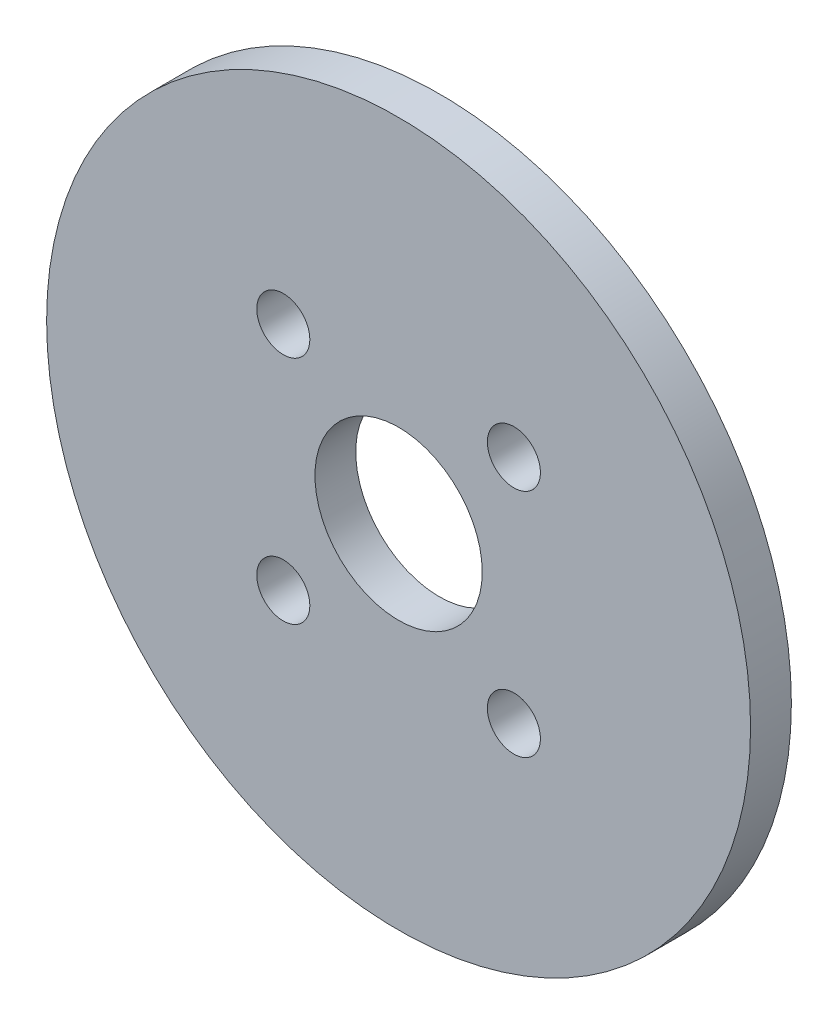
ISO-10303-21;
HEADER;
FILE_DESCRIPTION(('STEP AP214'),'2;1');
FILE_NAME('part.step','',(''),(''),'','','');
FILE_SCHEMA(('AUTOMOTIVE_DESIGN { 1 0 10303 214 1 1 1 1 }'));
ENDSEC;
DATA;
#1=APPLICATION_CONTEXT('core data for automotive mechanical design processes');
#2=APPLICATION_PROTOCOL_DEFINITION('international standard','automotive_design',2000,#1);
#3=PRODUCT_CONTEXT('',#1,'mechanical');
#4=PRODUCT('Part','Part','',(#3));
#5=PRODUCT_RELATED_PRODUCT_CATEGORY('part','',(#4));
#6=PRODUCT_DEFINITION_FORMATION('','',#4);
#7=PRODUCT_DEFINITION_CONTEXT('part definition',#1,'design');
#8=PRODUCT_DEFINITION('design','',#6,#7);
#9=PRODUCT_DEFINITION_SHAPE('','',#8);
#10=(LENGTH_UNIT() NAMED_UNIT(*) SI_UNIT(.MILLI.,.METRE.));
#11=(NAMED_UNIT(*) PLANE_ANGLE_UNIT() SI_UNIT($,.RADIAN.));
#12=(NAMED_UNIT(*) SI_UNIT($,.STERADIAN.) SOLID_ANGLE_UNIT());
#13=UNCERTAINTY_MEASURE_WITH_UNIT(LENGTH_MEASURE(1.E-05),#10,'distance_accuracy_value','');
#14=(GEOMETRIC_REPRESENTATION_CONTEXT(3) GLOBAL_UNCERTAINTY_ASSIGNED_CONTEXT((#13)) GLOBAL_UNIT_ASSIGNED_CONTEXT((#10,
#11,#12)) REPRESENTATION_CONTEXT('',''));
#15=CARTESIAN_POINT('',(0.,0.,0.));
#16=DIRECTION('',(0.,0.,1.));
#17=DIRECTION('',(1.,0.,0.));
#18=AXIS2_PLACEMENT_3D('',#15,#16,#17);
#19=CARTESIAN_POINT('',(0.,0.,2.));
#20=DIRECTION('',(0.,0.,1.));
#21=DIRECTION('',(1.,0.,0.));
#22=AXIS2_PLACEMENT_3D('',#19,#20,#21);
#23=PLANE('',#22);
#24=CARTESIAN_POINT('',(-5.65,-5.65,2.));
#25=DIRECTION('',(0.,0.,1.));
#26=DIRECTION('',(1.,0.,0.));
#27=AXIS2_PLACEMENT_3D('',#24,#25,#26);
#28=CIRCLE('',#27,1.3);
#29=CARTESIAN_POINT('',(-4.35,-5.65,2.));
#30=VERTEX_POINT('',#29);
#31=EDGE_CURVE('E62',#30,#30,#28,.T.);
#32=ORIENTED_EDGE('',*,*,#31,.F.);
#33=EDGE_LOOP('',(#32));
#34=FACE_BOUND('',#33,.T.);
#35=CARTESIAN_POINT('',(5.65,-5.65,2.));
#36=DIRECTION('',(0.,0.,1.));
#37=DIRECTION('',(1.,0.,0.));
#38=AXIS2_PLACEMENT_3D('',#35,#36,#37);
#39=CIRCLE('',#38,1.3);
#40=CARTESIAN_POINT('',(6.95,-5.65,2.));
#41=VERTEX_POINT('',#40);
#42=EDGE_CURVE('E50',#41,#41,#39,.T.);
#43=ORIENTED_EDGE('',*,*,#42,.F.);
#44=EDGE_LOOP('',(#43));
#45=FACE_BOUND('',#44,.T.);
#46=CARTESIAN_POINT('',(0.,0.,2.));
#47=DIRECTION('',(0.,0.,1.));
#48=DIRECTION('',(1.,0.,0.));
#49=AXIS2_PLACEMENT_3D('',#46,#47,#48);
#50=CIRCLE('',#49,17.25);
#51=CARTESIAN_POINT('',(17.25,0.,2.));
#52=VERTEX_POINT('',#51);
#53=EDGE_CURVE('E10',#52,#52,#50,.T.);
#54=ORIENTED_EDGE('',*,*,#53,.T.);
#55=EDGE_LOOP('',(#54));
#56=FACE_BOUND('',#55,.T.);
#57=CARTESIAN_POINT('',(5.65,5.65,2.));
#58=DIRECTION('',(0.,0.,1.));
#59=DIRECTION('',(1.,0.,0.));
#60=AXIS2_PLACEMENT_3D('',#57,#58,#59);
#61=CIRCLE('',#60,1.3);
#62=CARTESIAN_POINT('',(6.95,5.65,2.));
#63=VERTEX_POINT('',#62);
#64=EDGE_CURVE('E45',#63,#63,#61,.T.);
#65=ORIENTED_EDGE('',*,*,#64,.F.);
#66=EDGE_LOOP('',(#65));
#67=FACE_BOUND('',#66,.T.);
#68=CARTESIAN_POINT('',(-5.65,5.65,2.));
#69=DIRECTION('',(0.,0.,1.));
#70=DIRECTION('',(1.,0.,0.));
#71=AXIS2_PLACEMENT_3D('',#68,#69,#70);
#72=CIRCLE('',#71,1.3);
#73=CARTESIAN_POINT('',(-4.35,5.65,2.));
#74=VERTEX_POINT('',#73);
#75=EDGE_CURVE('E56',#74,#74,#72,.T.);
#76=ORIENTED_EDGE('',*,*,#75,.F.);
#77=EDGE_LOOP('',(#76));
#78=FACE_BOUND('',#77,.T.);
#79=CARTESIAN_POINT('',(0.,0.,2.));
#80=DIRECTION('',(0.,0.,1.));
#81=DIRECTION('',(1.,0.,0.));
#82=AXIS2_PLACEMENT_3D('',#79,#80,#81);
#83=CIRCLE('',#82,4.1);
#84=CARTESIAN_POINT('',(4.1,0.,2.));
#85=VERTEX_POINT('',#84);
#86=EDGE_CURVE('E68',#85,#85,#83,.T.);
#87=ORIENTED_EDGE('',*,*,#86,.F.);
#88=EDGE_LOOP('',(#87));
#89=FACE_BOUND('',#88,.T.);
#90=ADVANCED_FACE('F34',(#34,#45,#56,#67,#78,#89),#23,.T.);
#91=CARTESIAN_POINT('',(0.,0.,0.));
#92=DIRECTION('',(0.,0.,1.));
#93=DIRECTION('',(1.,0.,0.));
#94=AXIS2_PLACEMENT_3D('',#91,#92,#93);
#95=PLANE('',#94);
#96=CARTESIAN_POINT('',(0.,0.,0.));
#97=DIRECTION('',(0.,0.,1.));
#98=DIRECTION('',(1.,0.,0.));
#99=AXIS2_PLACEMENT_3D('',#96,#97,#98);
#100=CIRCLE('',#99,17.25);
#101=CARTESIAN_POINT('',(17.25,0.,0.));
#102=VERTEX_POINT('',#101);
#103=EDGE_CURVE('E38',#102,#102,#100,.T.);
#104=ORIENTED_EDGE('',*,*,#103,.F.);
#105=EDGE_LOOP('',(#104));
#106=FACE_BOUND('',#105,.T.);
#107=CARTESIAN_POINT('',(5.65,5.65,0.));
#108=DIRECTION('',(0.,0.,1.));
#109=DIRECTION('',(1.,0.,0.));
#110=AXIS2_PLACEMENT_3D('',#107,#108,#109);
#111=CIRCLE('',#110,1.3);
#112=CARTESIAN_POINT('',(6.95,5.65,0.));
#113=VERTEX_POINT('',#112);
#114=EDGE_CURVE('E47',#113,#113,#111,.T.);
#115=ORIENTED_EDGE('',*,*,#114,.T.);
#116=EDGE_LOOP('',(#115));
#117=FACE_BOUND('',#116,.T.);
#118=CARTESIAN_POINT('',(5.65,-5.65,0.));
#119=DIRECTION('',(0.,0.,1.));
#120=DIRECTION('',(1.,0.,0.));
#121=AXIS2_PLACEMENT_3D('',#118,#119,#120);
#122=CIRCLE('',#121,1.3);
#123=CARTESIAN_POINT('',(6.95,-5.65,0.));
#124=VERTEX_POINT('',#123);
#125=EDGE_CURVE('E53',#124,#124,#122,.T.);
#126=ORIENTED_EDGE('',*,*,#125,.T.);
#127=EDGE_LOOP('',(#126));
#128=FACE_BOUND('',#127,.T.);
#129=CARTESIAN_POINT('',(-5.65,5.65,0.));
#130=DIRECTION('',(0.,0.,1.));
#131=DIRECTION('',(1.,0.,0.));
#132=AXIS2_PLACEMENT_3D('',#129,#130,#131);
#133=CIRCLE('',#132,1.3);
#134=CARTESIAN_POINT('',(-4.35,5.65,0.));
#135=VERTEX_POINT('',#134);
#136=EDGE_CURVE('E59',#135,#135,#133,.T.);
#137=ORIENTED_EDGE('',*,*,#136,.T.);
#138=EDGE_LOOP('',(#137));
#139=FACE_BOUND('',#138,.T.);
#140=CARTESIAN_POINT('',(-5.65,-5.65,0.));
#141=DIRECTION('',(0.,0.,1.));
#142=DIRECTION('',(1.,0.,0.));
#143=AXIS2_PLACEMENT_3D('',#140,#141,#142);
#144=CIRCLE('',#143,1.3);
#145=CARTESIAN_POINT('',(-4.35,-5.65,0.));
#146=VERTEX_POINT('',#145);
#147=EDGE_CURVE('E65',#146,#146,#144,.T.);
#148=ORIENTED_EDGE('',*,*,#147,.T.);
#149=EDGE_LOOP('',(#148));
#150=FACE_BOUND('',#149,.T.);
#151=CARTESIAN_POINT('',(0.,0.,0.));
#152=DIRECTION('',(0.,0.,1.));
#153=DIRECTION('',(1.,0.,0.));
#154=AXIS2_PLACEMENT_3D('',#151,#152,#153);
#155=CIRCLE('',#154,4.1);
#156=CARTESIAN_POINT('',(4.1,0.,0.));
#157=VERTEX_POINT('',#156);
#158=EDGE_CURVE('E71',#157,#157,#155,.T.);
#159=ORIENTED_EDGE('',*,*,#158,.T.);
#160=EDGE_LOOP('',(#159));
#161=FACE_BOUND('',#160,.T.);
#162=ADVANCED_FACE('F81',(#106,#117,#128,#139,#150,#161),#95,.F.);
#163=CARTESIAN_POINT('',(0.,0.,2.));
#164=DIRECTION('',(0.,0.,-1.));
#165=DIRECTION('',(-1.,0.,0.));
#166=AXIS2_PLACEMENT_3D('',#163,#164,#165);
#167=CYLINDRICAL_SURFACE('',#166,17.25);
#168=ORIENTED_EDGE('',*,*,#53,.F.);
#169=EDGE_LOOP('',(#168));
#170=FACE_BOUND('',#169,.T.);
#171=ORIENTED_EDGE('',*,*,#103,.T.);
#172=EDGE_LOOP('',(#171));
#173=FACE_BOUND('',#172,.T.);
#174=ADVANCED_FACE('F36',(#170,#173),#167,.T.);
#175=CARTESIAN_POINT('',(5.65,5.65,2.));
#176=DIRECTION('',(0.,0.,-1.));
#177=DIRECTION('',(-1.,0.,0.));
#178=AXIS2_PLACEMENT_3D('',#175,#176,#177);
#179=CYLINDRICAL_SURFACE('',#178,1.3);
#180=ORIENTED_EDGE('',*,*,#64,.T.);
#181=EDGE_LOOP('',(#180));
#182=FACE_BOUND('',#181,.T.);
#183=ORIENTED_EDGE('',*,*,#114,.F.);
#184=EDGE_LOOP('',(#183));
#185=FACE_BOUND('',#184,.T.);
#186=ADVANCED_FACE('F91',(#182,#185),#179,.F.);
#187=CARTESIAN_POINT('',(5.65,-5.65,2.));
#188=DIRECTION('',(0.,0.,-1.));
#189=DIRECTION('',(-1.,0.,0.));
#190=AXIS2_PLACEMENT_3D('',#187,#188,#189);
#191=CYLINDRICAL_SURFACE('',#190,1.3);
#192=ORIENTED_EDGE('',*,*,#42,.T.);
#193=EDGE_LOOP('',(#192));
#194=FACE_BOUND('',#193,.T.);
#195=ORIENTED_EDGE('',*,*,#125,.F.);
#196=EDGE_LOOP('',(#195));
#197=FACE_BOUND('',#196,.T.);
#198=ADVANCED_FACE('F94',(#194,#197),#191,.F.);
#199=CARTESIAN_POINT('',(-5.65,5.65,2.));
#200=DIRECTION('',(0.,0.,-1.));
#201=DIRECTION('',(-1.,0.,0.));
#202=AXIS2_PLACEMENT_3D('',#199,#200,#201);
#203=CYLINDRICAL_SURFACE('',#202,1.3);
#204=ORIENTED_EDGE('',*,*,#75,.T.);
#205=EDGE_LOOP('',(#204));
#206=FACE_BOUND('',#205,.T.);
#207=ORIENTED_EDGE('',*,*,#136,.F.);
#208=EDGE_LOOP('',(#207));
#209=FACE_BOUND('',#208,.T.);
#210=ADVANCED_FACE('F98',(#206,#209),#203,.F.);
#211=CARTESIAN_POINT('',(-5.65,-5.65,2.));
#212=DIRECTION('',(0.,0.,-1.));
#213=DIRECTION('',(-1.,0.,0.));
#214=AXIS2_PLACEMENT_3D('',#211,#212,#213);
#215=CYLINDRICAL_SURFACE('',#214,1.3);
#216=ORIENTED_EDGE('',*,*,#31,.T.);
#217=EDGE_LOOP('',(#216));
#218=FACE_BOUND('',#217,.T.);
#219=ORIENTED_EDGE('',*,*,#147,.F.);
#220=EDGE_LOOP('',(#219));
#221=FACE_BOUND('',#220,.T.);
#222=ADVANCED_FACE('F102',(#218,#221),#215,.F.);
#223=CARTESIAN_POINT('',(0.,0.,2.));
#224=DIRECTION('',(0.,0.,-1.));
#225=DIRECTION('',(-1.,0.,0.));
#226=AXIS2_PLACEMENT_3D('',#223,#224,#225);
#227=CYLINDRICAL_SURFACE('',#226,4.1);
#228=ORIENTED_EDGE('',*,*,#86,.T.);
#229=EDGE_LOOP('',(#228));
#230=FACE_BOUND('',#229,.T.);
#231=ORIENTED_EDGE('',*,*,#158,.F.);
#232=EDGE_LOOP('',(#231));
#233=FACE_BOUND('',#232,.T.);
#234=ADVANCED_FACE('F77',(#230,#233),#227,.F.);
#235=CLOSED_SHELL('',(#90,#162,#174,#186,#198,#210,#222,#234));
#236=MANIFOLD_SOLID_BREP('B2',#235);
#237=ADVANCED_BREP_SHAPE_REPRESENTATION('',(#18,#236),#14);
#238=SHAPE_DEFINITION_REPRESENTATION(#9,#237);
ENDSEC;
END-ISO-10303-21;
